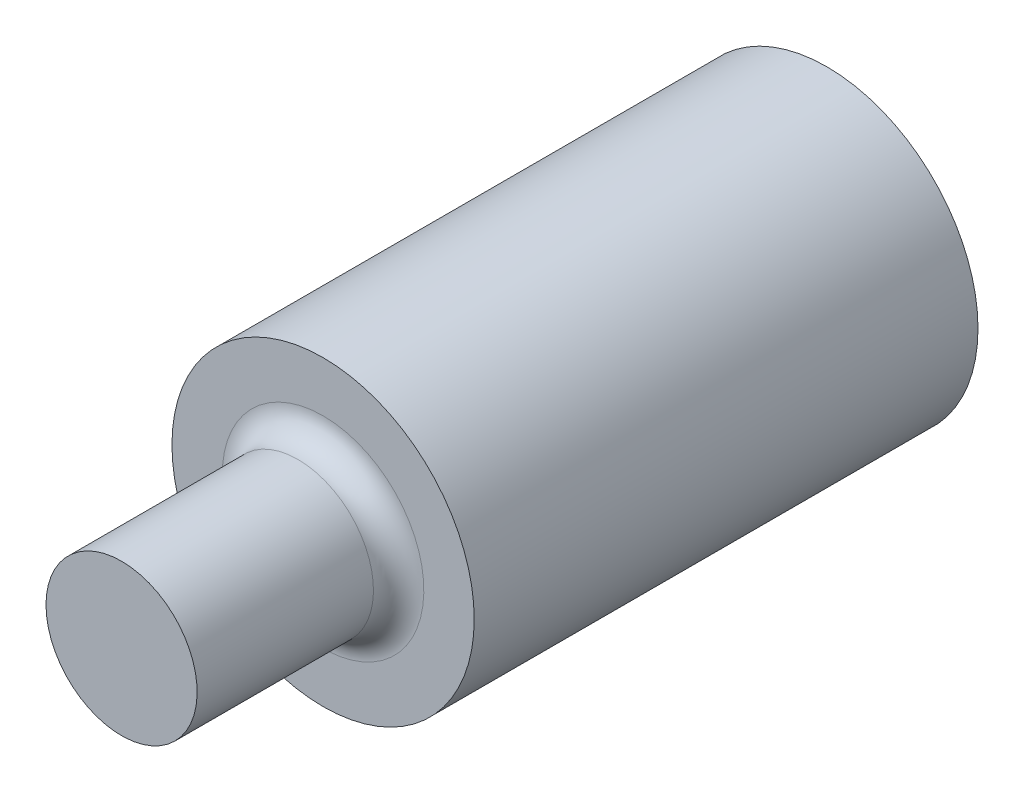
ISO-10303-21;
HEADER;
FILE_DESCRIPTION(('STEP AP214'),'2;1');
FILE_NAME('part.step','',(''),(''),'','','');
FILE_SCHEMA(('AUTOMOTIVE_DESIGN { 1 0 10303 214 1 1 1 1 }'));
ENDSEC;
DATA;
#1=APPLICATION_CONTEXT('core data for automotive mechanical design processes');
#2=APPLICATION_PROTOCOL_DEFINITION('international standard','automotive_design',2000,#1);
#3=PRODUCT_CONTEXT('',#1,'mechanical');
#4=PRODUCT('Part','Part','',(#3));
#5=PRODUCT_RELATED_PRODUCT_CATEGORY('part','',(#4));
#6=PRODUCT_DEFINITION_FORMATION('','',#4);
#7=PRODUCT_DEFINITION_CONTEXT('part definition',#1,'design');
#8=PRODUCT_DEFINITION('design','',#6,#7);
#9=PRODUCT_DEFINITION_SHAPE('','',#8);
#10=(LENGTH_UNIT() NAMED_UNIT(*) SI_UNIT(.MILLI.,.METRE.));
#11=(NAMED_UNIT(*) PLANE_ANGLE_UNIT() SI_UNIT($,.RADIAN.));
#12=(NAMED_UNIT(*) SI_UNIT($,.STERADIAN.) SOLID_ANGLE_UNIT());
#13=UNCERTAINTY_MEASURE_WITH_UNIT(LENGTH_MEASURE(1.E-05),#10,'distance_accuracy_value','');
#14=(GEOMETRIC_REPRESENTATION_CONTEXT(3) GLOBAL_UNCERTAINTY_ASSIGNED_CONTEXT((#13)) GLOBAL_UNIT_ASSIGNED_CONTEXT((#10,
#11,#12)) REPRESENTATION_CONTEXT('',''));
#15=CARTESIAN_POINT('',(0.,0.,0.));
#16=DIRECTION('',(0.,0.,1.));
#17=DIRECTION('',(1.,0.,0.));
#18=AXIS2_PLACEMENT_3D('',#15,#16,#17);
#19=CARTESIAN_POINT('',(0.,1.5,-34.));
#20=DIRECTION('',(0.,0.,-1.));
#21=DIRECTION('',(0.,1.,0.));
#22=AXIS2_PLACEMENT_3D('',#19,#20,#21);
#23=PLANE('',#22);
#24=CARTESIAN_POINT('',(0.,0.,-34.));
#25=DIRECTION('',(0.,0.,-1.));
#26=DIRECTION('',(0.,1.,0.));
#27=AXIS2_PLACEMENT_3D('',#24,#25,#26);
#28=CIRCLE('',#27,1.50000000000001);
#29=CARTESIAN_POINT('',(0.,1.5,-34.));
#30=VERTEX_POINT('',#29);
#31=EDGE_CURVE('E10',#30,#30,#28,.T.);
#32=ORIENTED_EDGE('',*,*,#31,.T.);
#33=EDGE_LOOP('',(#32));
#34=FACE_BOUND('',#33,.T.);
#35=ADVANCED_FACE('F31',(#34),#23,.T.);
#36=CARTESIAN_POINT('',(0.,0.,-34.));
#37=DIRECTION('',(0.,0.,-1.));
#38=DIRECTION('',(0.,1.,0.));
#39=AXIS2_PLACEMENT_3D('',#36,#37,#38);
#40=CYLINDRICAL_SURFACE('',#39,1.50000000000001);
#41=CARTESIAN_POINT('',(0.,0.,-29.));
#42=DIRECTION('',(0.,0.,-1.));
#43=DIRECTION('',(0.,1.,0.));
#44=AXIS2_PLACEMENT_3D('',#41,#42,#43);
#45=CIRCLE('',#44,1.50000000000001);
#46=CARTESIAN_POINT('',(0.,1.5,-29.));
#47=VERTEX_POINT('',#46);
#48=EDGE_CURVE('E38',#47,#47,#45,.T.);
#49=ORIENTED_EDGE('',*,*,#48,.T.);
#50=EDGE_LOOP('',(#49));
#51=FACE_BOUND('',#50,.T.);
#52=ORIENTED_EDGE('',*,*,#31,.F.);
#53=EDGE_LOOP('',(#52));
#54=FACE_BOUND('',#53,.T.);
#55=ADVANCED_FACE('F71',(#51,#54),#40,.T.);
#56=CARTESIAN_POINT('',(0.,0.999999999999993,-29.));
#57=DIRECTION('',(0.,0.,1.));
#58=DIRECTION('',(0.,-1.,0.));
#59=AXIS2_PLACEMENT_3D('',#56,#57,#58);
#60=PLANE('',#59);
#61=CARTESIAN_POINT('',(0.,0.,-29.));
#62=DIRECTION('',(0.,0.,-1.));
#63=DIRECTION('',(0.,1.,0.));
#64=AXIS2_PLACEMENT_3D('',#61,#62,#63);
#65=CIRCLE('',#64,0.999999999999999);
#66=CARTESIAN_POINT('',(0.,0.999999999999993,-29.));
#67=VERTEX_POINT('',#66);
#68=EDGE_CURVE('E42',#67,#67,#65,.T.);
#69=ORIENTED_EDGE('',*,*,#68,.T.);
#70=EDGE_LOOP('',(#69));
#71=FACE_BOUND('',#70,.T.);
#72=ORIENTED_EDGE('',*,*,#48,.F.);
#73=EDGE_LOOP('',(#72));
#74=FACE_BOUND('',#73,.T.);
#75=ADVANCED_FACE('F68',(#71,#74),#60,.T.);
#76=CARTESIAN_POINT('',(0.,0.,-28.75));
#77=DIRECTION('',(0.,0.,-1.));
#78=DIRECTION('',(0.,1.,0.));
#79=AXIS2_PLACEMENT_3D('',#76,#77,#78);
#80=TOROIDAL_SURFACE('',#79,0.999999999999999,0.25);
#81=CARTESIAN_POINT('',(0.,0.,-28.75));
#82=DIRECTION('',(0.,0.,-1.));
#83=DIRECTION('',(0.,1.,0.));
#84=AXIS2_PLACEMENT_3D('',#81,#82,#83);
#85=CIRCLE('',#84,0.749999999999999);
#86=CARTESIAN_POINT('',(0.,0.749999999999993,-28.75));
#87=VERTEX_POINT('',#86);
#88=EDGE_CURVE('E47',#87,#87,#85,.T.);
#89=ORIENTED_EDGE('',*,*,#88,.T.);
#90=EDGE_LOOP('',(#89));
#91=FACE_BOUND('',#90,.T.);
#92=ORIENTED_EDGE('',*,*,#68,.F.);
#93=EDGE_LOOP('',(#92));
#94=FACE_BOUND('',#93,.T.);
#95=ADVANCED_FACE('F59',(#91,#94),#80,.F.);
#96=CARTESIAN_POINT('',(0.,0.,-34.));
#97=DIRECTION('',(0.,0.,-1.));
#98=DIRECTION('',(0.,1.,0.));
#99=AXIS2_PLACEMENT_3D('',#96,#97,#98);
#100=CYLINDRICAL_SURFACE('',#99,0.749999999999996);
#101=CARTESIAN_POINT('',(0.,0.,-27.));
#102=DIRECTION('',(0.,0.,-1.));
#103=DIRECTION('',(-1.,0.,0.));
#104=AXIS2_PLACEMENT_3D('',#101,#102,#103);
#105=CIRCLE('',#104,0.749999999999996);
#106=CARTESIAN_POINT('',(-0.749999999999996,0.,-27.));
#107=VERTEX_POINT('',#106);
#108=EDGE_CURVE('E34',#107,#107,#105,.F.);
#109=ORIENTED_EDGE('',*,*,#108,.F.);
#110=EDGE_LOOP('',(#109));
#111=FACE_BOUND('',#110,.T.);
#112=ORIENTED_EDGE('',*,*,#88,.F.);
#113=EDGE_LOOP('',(#112));
#114=FACE_BOUND('',#113,.T.);
#115=ADVANCED_FACE('F56',(#111,#114),#100,.T.);
#116=CARTESIAN_POINT('',(-1.50000000000001,1.69133192389005,-27.));
#117=DIRECTION('',(0.,0.,-1.));
#118=DIRECTION('',(-1.,0.,0.));
#119=AXIS2_PLACEMENT_3D('',#116,#117,#118);
#120=PLANE('',#119);
#121=ORIENTED_EDGE('',*,*,#108,.T.);
#122=EDGE_LOOP('',(#121));
#123=FACE_BOUND('',#122,.T.);
#124=ADVANCED_FACE('F54',(#123),#120,.F.);
#125=CLOSED_SHELL('',(#35,#55,#75,#95,#115,#124));
#126=MANIFOLD_SOLID_BREP('B2',#125);
#127=ADVANCED_BREP_SHAPE_REPRESENTATION('',(#18,#126),#14);
#128=SHAPE_DEFINITION_REPRESENTATION(#9,#127);
ENDSEC;
END-ISO-10303-21;
